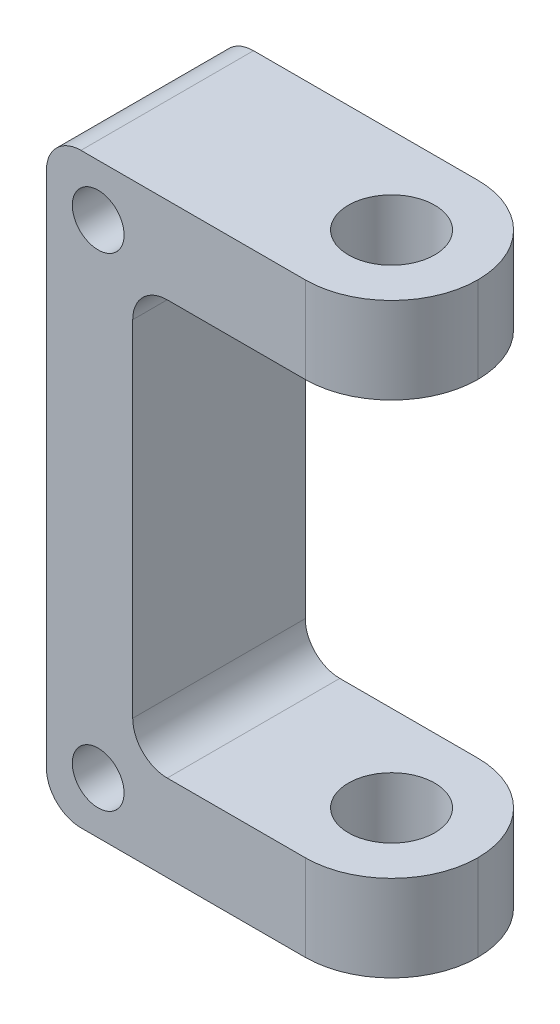
ISO-10303-21;
HEADER;
FILE_DESCRIPTION(('STEP AP214'),'2;1');
FILE_NAME('part.step','',(''),(''),'','','');
FILE_SCHEMA(('AUTOMOTIVE_DESIGN { 1 0 10303 214 1 1 1 1 }'));
ENDSEC;
DATA;
#1=APPLICATION_CONTEXT('core data for automotive mechanical design processes');
#2=APPLICATION_PROTOCOL_DEFINITION('international standard','automotive_design',2000,#1);
#3=PRODUCT_CONTEXT('',#1,'mechanical');
#4=PRODUCT('Part','Part','',(#3));
#5=PRODUCT_RELATED_PRODUCT_CATEGORY('part','',(#4));
#6=PRODUCT_DEFINITION_FORMATION('','',#4);
#7=PRODUCT_DEFINITION_CONTEXT('part definition',#1,'design');
#8=PRODUCT_DEFINITION('design','',#6,#7);
#9=PRODUCT_DEFINITION_SHAPE('','',#8);
#10=(LENGTH_UNIT() NAMED_UNIT(*) SI_UNIT(.MILLI.,.METRE.));
#11=(NAMED_UNIT(*) PLANE_ANGLE_UNIT() SI_UNIT($,.RADIAN.));
#12=(NAMED_UNIT(*) SI_UNIT($,.STERADIAN.) SOLID_ANGLE_UNIT());
#13=UNCERTAINTY_MEASURE_WITH_UNIT(LENGTH_MEASURE(1.E-05),#10,'distance_accuracy_value','');
#14=(GEOMETRIC_REPRESENTATION_CONTEXT(3) GLOBAL_UNCERTAINTY_ASSIGNED_CONTEXT((#13)) GLOBAL_UNIT_ASSIGNED_CONTEXT((#10,
#11,#12)) REPRESENTATION_CONTEXT('',''));
#15=CARTESIAN_POINT('',(0.,0.,0.));
#16=DIRECTION('',(0.,0.,1.));
#17=DIRECTION('',(1.,0.,0.));
#18=AXIS2_PLACEMENT_3D('',#15,#16,#17);
#19=CARTESIAN_POINT('',(-6.35,0.,6.35));
#20=DIRECTION('',(1.,0.,0.));
#21=DIRECTION('',(0.,1.,0.));
#22=AXIS2_PLACEMENT_3D('',#19,#20,#21);
#23=PLANE('',#22);
#24=DIRECTION('',(0.,-1.,0.));
#25=VECTOR('',#24,1.);
#26=CARTESIAN_POINT('',(-6.35,0.,6.35));
#27=LINE('',#26,#25);
#28=CARTESIAN_POINT('',(-6.35,12.7,6.35));
#29=VERTEX_POINT('',#28);
#30=CARTESIAN_POINT('',(-6.35,-12.7,6.35));
#31=VERTEX_POINT('',#30);
#32=EDGE_CURVE('E284',#29,#31,#27,.T.);
#33=ORIENTED_EDGE('',*,*,#32,.T.);
#34=DIRECTION('',(0.,0.,-1.));
#35=VECTOR('',#34,1.);
#36=CARTESIAN_POINT('',(-6.35,-12.7,6.35));
#37=LINE('',#36,#35);
#38=CARTESIAN_POINT('',(-6.35,-12.7,-6.35));
#39=VERTEX_POINT('',#38);
#40=EDGE_CURVE('E221',#31,#39,#37,.T.);
#41=ORIENTED_EDGE('',*,*,#40,.T.);
#42=DIRECTION('',(0.,-1.,0.));
#43=VECTOR('',#42,1.);
#44=CARTESIAN_POINT('',(-6.35,0.,-6.35));
#45=LINE('',#44,#43);
#46=CARTESIAN_POINT('',(-6.35,12.7,-6.35));
#47=VERTEX_POINT('',#46);
#48=EDGE_CURVE('E263',#47,#39,#45,.T.);
#49=ORIENTED_EDGE('',*,*,#48,.F.);
#50=DIRECTION('',(0.,0.,-1.));
#51=VECTOR('',#50,1.);
#52=CARTESIAN_POINT('',(-6.35,12.7,6.35));
#53=LINE('',#52,#51);
#54=EDGE_CURVE('E210',#47,#29,#53,.F.);
#55=ORIENTED_EDGE('',*,*,#54,.T.);
#56=EDGE_LOOP('',(#33,#41,#49,#55));
#57=FACE_BOUND('',#56,.T.);
#58=ADVANCED_FACE('F41',(#57),#23,.T.);
#59=CARTESIAN_POINT('',(0.,15.24,6.35));
#60=DIRECTION('',(0.,-1.,0.));
#61=DIRECTION('',(1.,0.,0.));
#62=AXIS2_PLACEMENT_3D('',#59,#60,#61);
#63=PLANE('',#62);
#64=CARTESIAN_POINT('',(6.34999999999999,15.24,0.));
#65=DIRECTION('',(0.,-1.,0.));
#66=DIRECTION('',(1.,0.,0.));
#67=AXIS2_PLACEMENT_3D('',#64,#65,#66);
#68=CIRCLE('',#67,3.175);
#69=CARTESIAN_POINT('',(9.525,15.24,0.));
#70=VERTEX_POINT('',#69);
#71=EDGE_CURVE('E311',#70,#70,#68,.T.);
#72=ORIENTED_EDGE('',*,*,#71,.F.);
#73=EDGE_LOOP('',(#72));
#74=FACE_BOUND('',#73,.T.);
#75=DIRECTION('',(-1.,0.,0.));
#76=VECTOR('',#75,1.);
#77=CARTESIAN_POINT('',(0.,15.24,6.35));
#78=LINE('',#77,#76);
#79=CARTESIAN_POINT('',(6.35,15.24,6.35));
#80=VERTEX_POINT('',#79);
#81=CARTESIAN_POINT('',(-3.81,15.24,6.35));
#82=VERTEX_POINT('',#81);
#83=EDGE_CURVE('E282',#80,#82,#78,.T.);
#84=ORIENTED_EDGE('',*,*,#83,.T.);
#85=DIRECTION('',(0.,0.,-1.));
#86=VECTOR('',#85,1.);
#87=CARTESIAN_POINT('',(-3.81,15.24,-6.35));
#88=LINE('',#87,#86);
#89=CARTESIAN_POINT('',(-3.81,15.24,-6.35));
#90=VERTEX_POINT('',#89);
#91=EDGE_CURVE('E228',#82,#90,#88,.T.);
#92=ORIENTED_EDGE('',*,*,#91,.T.);
#93=DIRECTION('',(-1.,0.,0.));
#94=VECTOR('',#93,1.);
#95=CARTESIAN_POINT('',(0.,15.24,-6.35));
#96=LINE('',#95,#94);
#97=CARTESIAN_POINT('',(6.35,15.24,-6.35));
#98=VERTEX_POINT('',#97);
#99=EDGE_CURVE('E265',#98,#90,#96,.T.);
#100=ORIENTED_EDGE('',*,*,#99,.F.);
#101=CARTESIAN_POINT('',(6.35,15.24,0.));
#102=DIRECTION('',(0.,-1.,0.));
#103=DIRECTION('',(1.,0.,0.));
#104=AXIS2_PLACEMENT_3D('',#101,#102,#103);
#105=CIRCLE('',#104,6.35);
#106=CARTESIAN_POINT('',(12.7,15.24,0.));
#107=VERTEX_POINT('',#106);
#108=EDGE_CURVE('E200',#98,#107,#105,.T.);
#109=ORIENTED_EDGE('',*,*,#108,.T.);
#110=CARTESIAN_POINT('',(6.35,15.24,0.));
#111=DIRECTION('',(0.,-1.,0.));
#112=DIRECTION('',(1.,0.,0.));
#113=AXIS2_PLACEMENT_3D('',#110,#111,#112);
#114=CIRCLE('',#113,6.35);
#115=EDGE_CURVE('E197',#107,#80,#114,.T.);
#116=ORIENTED_EDGE('',*,*,#115,.T.);
#117=EDGE_LOOP('',(#84,#92,#100,#109,#116));
#118=FACE_BOUND('',#117,.T.);
#119=ADVANCED_FACE('F286',(#74,#118),#63,.T.);
#120=CARTESIAN_POINT('',(0.,21.59,6.35));
#121=DIRECTION('',(0.,1.,0.));
#122=DIRECTION('',(-1.,0.,0.));
#123=AXIS2_PLACEMENT_3D('',#120,#121,#122);
#124=PLANE('',#123);
#125=CARTESIAN_POINT('',(6.34999999999999,21.59,0.));
#126=DIRECTION('',(0.,1.,0.));
#127=DIRECTION('',(0.,0.,1.));
#128=AXIS2_PLACEMENT_3D('',#125,#126,#127);
#129=CIRCLE('',#128,3.175);
#130=CARTESIAN_POINT('',(6.34999999999999,21.59,3.175));
#131=VERTEX_POINT('',#130);
#132=EDGE_CURVE('E214',#131,#131,#129,.T.);
#133=ORIENTED_EDGE('',*,*,#132,.F.);
#134=EDGE_LOOP('',(#133));
#135=FACE_BOUND('',#134,.T.);
#136=DIRECTION('',(1.,0.,0.));
#137=VECTOR('',#136,1.);
#138=CARTESIAN_POINT('',(0.,21.59,-6.35));
#139=LINE('',#138,#137);
#140=CARTESIAN_POINT('',(-10.16,21.59,-6.35));
#141=VERTEX_POINT('',#140);
#142=CARTESIAN_POINT('',(6.35,21.59,-6.35));
#143=VERTEX_POINT('',#142);
#144=EDGE_CURVE('E317',#141,#143,#139,.T.);
#145=ORIENTED_EDGE('',*,*,#144,.F.);
#146=DIRECTION('',(0.,0.,-1.));
#147=VECTOR('',#146,1.);
#148=CARTESIAN_POINT('',(-10.16,21.59,6.35));
#149=LINE('',#148,#147);
#150=CARTESIAN_POINT('',(-10.16,21.59,6.35));
#151=VERTEX_POINT('',#150);
#152=EDGE_CURVE('E57',#141,#151,#149,.F.);
#153=ORIENTED_EDGE('',*,*,#152,.T.);
#154=DIRECTION('',(1.,0.,0.));
#155=VECTOR('',#154,1.);
#156=CARTESIAN_POINT('',(0.,21.59,6.35));
#157=LINE('',#156,#155);
#158=CARTESIAN_POINT('',(6.35,21.59,6.35));
#159=VERTEX_POINT('',#158);
#160=EDGE_CURVE('E289',#151,#159,#157,.T.);
#161=ORIENTED_EDGE('',*,*,#160,.T.);
#162=CARTESIAN_POINT('',(6.35,21.59,0.));
#163=DIRECTION('',(0.,1.,0.));
#164=DIRECTION('',(-1.,0.,0.));
#165=AXIS2_PLACEMENT_3D('',#162,#163,#164);
#166=CIRCLE('',#165,6.35);
#167=CARTESIAN_POINT('',(12.7,21.59,0.));
#168=VERTEX_POINT('',#167);
#169=EDGE_CURVE('E203',#159,#168,#166,.T.);
#170=ORIENTED_EDGE('',*,*,#169,.T.);
#171=CARTESIAN_POINT('',(6.35,21.59,0.));
#172=DIRECTION('',(0.,1.,0.));
#173=DIRECTION('',(-1.,0.,0.));
#174=AXIS2_PLACEMENT_3D('',#171,#172,#173);
#175=CIRCLE('',#174,6.35);
#176=EDGE_CURVE('E206',#168,#143,#175,.T.);
#177=ORIENTED_EDGE('',*,*,#176,.T.);
#178=EDGE_LOOP('',(#145,#153,#161,#170,#177));
#179=FACE_BOUND('',#178,.T.);
#180=ADVANCED_FACE('F370',(#135,#179),#124,.T.);
#181=CARTESIAN_POINT('',(-12.7,0.,6.35));
#182=DIRECTION('',(1.,0.,0.));
#183=DIRECTION('',(0.,1.,0.));
#184=AXIS2_PLACEMENT_3D('',#181,#182,#183);
#185=PLANE('',#184);
#186=DIRECTION('',(0.,-1.,0.));
#187=VECTOR('',#186,1.);
#188=CARTESIAN_POINT('',(-12.7,0.,-6.35));
#189=LINE('',#188,#187);
#190=CARTESIAN_POINT('',(-12.7,19.05,-6.35));
#191=VERTEX_POINT('',#190);
#192=CARTESIAN_POINT('',(-12.7,-19.05,-6.35));
#193=VERTEX_POINT('',#192);
#194=EDGE_CURVE('E320',#191,#193,#189,.T.);
#195=ORIENTED_EDGE('',*,*,#194,.T.);
#196=DIRECTION('',(0.,0.,-1.));
#197=VECTOR('',#196,1.);
#198=CARTESIAN_POINT('',(-12.7,-19.05,6.35));
#199=LINE('',#198,#197);
#200=CARTESIAN_POINT('',(-12.7,-19.05,6.35));
#201=VERTEX_POINT('',#200);
#202=EDGE_CURVE('E65',#193,#201,#199,.F.);
#203=ORIENTED_EDGE('',*,*,#202,.T.);
#204=DIRECTION('',(0.,-1.,0.));
#205=VECTOR('',#204,1.);
#206=CARTESIAN_POINT('',(-12.7,0.,6.35));
#207=LINE('',#206,#205);
#208=CARTESIAN_POINT('',(-12.7,19.05,6.35));
#209=VERTEX_POINT('',#208);
#210=EDGE_CURVE('E293',#209,#201,#207,.T.);
#211=ORIENTED_EDGE('',*,*,#210,.F.);
#212=DIRECTION('',(0.,0.,-1.));
#213=VECTOR('',#212,1.);
#214=CARTESIAN_POINT('',(-12.7,19.05,-6.35));
#215=LINE('',#214,#213);
#216=EDGE_CURVE('E242',#209,#191,#215,.T.);
#217=ORIENTED_EDGE('',*,*,#216,.T.);
#218=EDGE_LOOP('',(#195,#203,#211,#217));
#219=FACE_BOUND('',#218,.T.);
#220=ADVANCED_FACE('F416',(#219),#185,.F.);
#221=CARTESIAN_POINT('',(0.,-21.59,6.35));
#222=DIRECTION('',(0.,1.,0.));
#223=DIRECTION('',(0.,0.,1.));
#224=AXIS2_PLACEMENT_3D('',#221,#222,#223);
#225=PLANE('',#224);
#226=CARTESIAN_POINT('',(6.34999999999999,-21.59,0.));
#227=DIRECTION('',(0.,1.,0.));
#228=DIRECTION('',(0.,0.,1.));
#229=AXIS2_PLACEMENT_3D('',#226,#227,#228);
#230=CIRCLE('',#229,3.175);
#231=CARTESIAN_POINT('',(6.34999999999999,-21.59,3.175));
#232=VERTEX_POINT('',#231);
#233=EDGE_CURVE('E327',#232,#232,#230,.T.);
#234=ORIENTED_EDGE('',*,*,#233,.T.);
#235=EDGE_LOOP('',(#234));
#236=FACE_BOUND('',#235,.T.);
#237=DIRECTION('',(1.,0.,0.));
#238=VECTOR('',#237,1.);
#239=CARTESIAN_POINT('',(0.,-21.59,6.35));
#240=LINE('',#239,#238);
#241=CARTESIAN_POINT('',(-10.16,-21.59,6.35));
#242=VERTEX_POINT('',#241);
#243=CARTESIAN_POINT('',(6.35,-21.59,6.35));
#244=VERTEX_POINT('',#243);
#245=EDGE_CURVE('E301',#242,#244,#240,.T.);
#246=ORIENTED_EDGE('',*,*,#245,.F.);
#247=DIRECTION('',(0.,0.,-1.));
#248=VECTOR('',#247,1.);
#249=CARTESIAN_POINT('',(-10.16,-21.59,6.35));
#250=LINE('',#249,#248);
#251=CARTESIAN_POINT('',(-10.16,-21.59,-6.35));
#252=VERTEX_POINT('',#251);
#253=EDGE_CURVE('E232',#242,#252,#250,.T.);
#254=ORIENTED_EDGE('',*,*,#253,.T.);
#255=DIRECTION('',(1.,0.,0.));
#256=VECTOR('',#255,1.);
#257=CARTESIAN_POINT('',(0.,-21.59,-6.35));
#258=LINE('',#257,#256);
#259=CARTESIAN_POINT('',(6.35,-21.59,-6.35));
#260=VERTEX_POINT('',#259);
#261=EDGE_CURVE('E169',#252,#260,#258,.T.);
#262=ORIENTED_EDGE('',*,*,#261,.T.);
#263=CARTESIAN_POINT('',(6.35,-21.59,0.));
#264=DIRECTION('',(0.,1.,0.));
#265=DIRECTION('',(0.,0.,1.));
#266=AXIS2_PLACEMENT_3D('',#263,#264,#265);
#267=CIRCLE('',#266,6.35);
#268=CARTESIAN_POINT('',(12.7,-21.59,0.));
#269=VERTEX_POINT('',#268);
#270=EDGE_CURVE('E173',#260,#269,#267,.F.);
#271=ORIENTED_EDGE('',*,*,#270,.T.);
#272=CARTESIAN_POINT('',(6.35,-21.59,0.));
#273=DIRECTION('',(0.,1.,0.));
#274=DIRECTION('',(0.,0.,1.));
#275=AXIS2_PLACEMENT_3D('',#272,#273,#274);
#276=CIRCLE('',#275,6.35);
#277=EDGE_CURVE('E175',#269,#244,#276,.F.);
#278=ORIENTED_EDGE('',*,*,#277,.T.);
#279=EDGE_LOOP('',(#246,#254,#262,#271,#278));
#280=FACE_BOUND('',#279,.T.);
#281=ADVANCED_FACE('F377',(#236,#280),#225,.F.);
#282=CARTESIAN_POINT('',(-8.89,17.78,6.35));
#283=DIRECTION('',(0.,0.,-1.));
#284=DIRECTION('',(-1.,0.,0.));
#285=AXIS2_PLACEMENT_3D('',#282,#283,#284);
#286=CYLINDRICAL_SURFACE('',#285,1.905);
#287=CARTESIAN_POINT('',(-8.89,17.78,6.35));
#288=DIRECTION('',(0.,0.,1.));
#289=DIRECTION('',(1.,0.,0.));
#290=AXIS2_PLACEMENT_3D('',#287,#288,#289);
#291=CIRCLE('',#290,1.905);
#292=CARTESIAN_POINT('',(-6.985,17.78,6.35));
#293=VERTEX_POINT('',#292);
#294=EDGE_CURVE('E295',#293,#293,#291,.T.);
#295=ORIENTED_EDGE('',*,*,#294,.T.);
#296=EDGE_LOOP('',(#295));
#297=FACE_BOUND('',#296,.T.);
#298=CARTESIAN_POINT('',(-8.89,17.78,-6.35));
#299=DIRECTION('',(0.,0.,1.));
#300=DIRECTION('',(1.,0.,0.));
#301=AXIS2_PLACEMENT_3D('',#298,#299,#300);
#302=CIRCLE('',#301,1.905);
#303=CARTESIAN_POINT('',(-6.985,17.78,-6.35));
#304=VERTEX_POINT('',#303);
#305=EDGE_CURVE('E274',#304,#304,#302,.T.);
#306=ORIENTED_EDGE('',*,*,#305,.F.);
#307=EDGE_LOOP('',(#306));
#308=FACE_BOUND('',#307,.T.);
#309=ADVANCED_FACE('F348',(#297,#308),#286,.F.);
#310=CARTESIAN_POINT('',(-8.89,-17.78,6.35));
#311=DIRECTION('',(0.,0.,-1.));
#312=DIRECTION('',(-1.,0.,0.));
#313=AXIS2_PLACEMENT_3D('',#310,#311,#312);
#314=CYLINDRICAL_SURFACE('',#313,1.905);
#315=CARTESIAN_POINT('',(-8.89,-17.78,6.35));
#316=DIRECTION('',(0.,0.,1.));
#317=DIRECTION('',(1.,0.,0.));
#318=AXIS2_PLACEMENT_3D('',#315,#316,#317);
#319=CIRCLE('',#318,1.905);
#320=CARTESIAN_POINT('',(-6.985,-17.78,6.35));
#321=VERTEX_POINT('',#320);
#322=EDGE_CURVE('E168',#321,#321,#319,.T.);
#323=ORIENTED_EDGE('',*,*,#322,.T.);
#324=EDGE_LOOP('',(#323));
#325=FACE_BOUND('',#324,.T.);
#326=CARTESIAN_POINT('',(-8.89,-17.78,-6.35));
#327=DIRECTION('',(0.,0.,1.));
#328=DIRECTION('',(1.,0.,0.));
#329=AXIS2_PLACEMENT_3D('',#326,#327,#328);
#330=CIRCLE('',#329,1.905);
#331=CARTESIAN_POINT('',(-6.985,-17.78,-6.35));
#332=VERTEX_POINT('',#331);
#333=EDGE_CURVE('E307',#332,#332,#330,.T.);
#334=ORIENTED_EDGE('',*,*,#333,.F.);
#335=EDGE_LOOP('',(#334));
#336=FACE_BOUND('',#335,.T.);
#337=ADVANCED_FACE('F361',(#325,#336),#314,.F.);
#338=CARTESIAN_POINT('',(0.,-15.24,6.35));
#339=DIRECTION('',(0.,-1.,0.));
#340=DIRECTION('',(1.,0.,0.));
#341=AXIS2_PLACEMENT_3D('',#338,#339,#340);
#342=PLANE('',#341);
#343=CARTESIAN_POINT('',(6.34999999999999,-15.24,0.));
#344=DIRECTION('',(0.,-1.,0.));
#345=DIRECTION('',(1.,0.,0.));
#346=AXIS2_PLACEMENT_3D('',#343,#344,#345);
#347=CIRCLE('',#346,3.175);
#348=CARTESIAN_POINT('',(9.525,-15.24,0.));
#349=VERTEX_POINT('',#348);
#350=EDGE_CURVE('E324',#349,#349,#347,.T.);
#351=ORIENTED_EDGE('',*,*,#350,.T.);
#352=EDGE_LOOP('',(#351));
#353=FACE_BOUND('',#352,.T.);
#354=DIRECTION('',(-1.,0.,0.));
#355=VECTOR('',#354,1.);
#356=CARTESIAN_POINT('',(0.,-15.24,-6.35));
#357=LINE('',#356,#355);
#358=CARTESIAN_POINT('',(6.35,-15.24,-6.35));
#359=VERTEX_POINT('',#358);
#360=CARTESIAN_POINT('',(-3.81,-15.24,-6.35));
#361=VERTEX_POINT('',#360);
#362=EDGE_CURVE('E148',#359,#361,#357,.T.);
#363=ORIENTED_EDGE('',*,*,#362,.T.);
#364=DIRECTION('',(0.,0.,-1.));
#365=VECTOR('',#364,1.);
#366=CARTESIAN_POINT('',(-3.81,-15.24,6.35));
#367=LINE('',#366,#365);
#368=CARTESIAN_POINT('',(-3.81,-15.24,6.35));
#369=VERTEX_POINT('',#368);
#370=EDGE_CURVE('E225',#361,#369,#367,.F.);
#371=ORIENTED_EDGE('',*,*,#370,.T.);
#372=DIRECTION('',(-1.,0.,0.));
#373=VECTOR('',#372,1.);
#374=CARTESIAN_POINT('',(0.,-15.24,6.35));
#375=LINE('',#374,#373);
#376=CARTESIAN_POINT('',(6.35,-15.24,6.35));
#377=VERTEX_POINT('',#376);
#378=EDGE_CURVE('E183',#377,#369,#375,.T.);
#379=ORIENTED_EDGE('',*,*,#378,.F.);
#380=CARTESIAN_POINT('',(6.35,-15.24,0.));
#381=DIRECTION('',(0.,-1.,0.));
#382=DIRECTION('',(1.,0.,0.));
#383=AXIS2_PLACEMENT_3D('',#380,#381,#382);
#384=CIRCLE('',#383,6.35);
#385=CARTESIAN_POINT('',(12.7,-15.24,0.));
#386=VERTEX_POINT('',#385);
#387=EDGE_CURVE('E152',#377,#386,#384,.F.);
#388=ORIENTED_EDGE('',*,*,#387,.T.);
#389=CARTESIAN_POINT('',(6.35,-15.24,0.));
#390=DIRECTION('',(0.,-1.,0.));
#391=DIRECTION('',(1.,0.,0.));
#392=AXIS2_PLACEMENT_3D('',#389,#390,#391);
#393=CIRCLE('',#392,6.35);
#394=EDGE_CURVE('E145',#386,#359,#393,.F.);
#395=ORIENTED_EDGE('',*,*,#394,.T.);
#396=EDGE_LOOP('',(#363,#371,#379,#388,#395));
#397=FACE_BOUND('',#396,.T.);
#398=ADVANCED_FACE('F147',(#353,#397),#342,.F.);
#399=CARTESIAN_POINT('',(0.,0.,6.35));
#400=DIRECTION('',(0.,0.,1.));
#401=DIRECTION('',(1.,0.,0.));
#402=AXIS2_PLACEMENT_3D('',#399,#400,#401);
#403=PLANE('',#402);
#404=ORIENTED_EDGE('',*,*,#322,.F.);
#405=EDGE_LOOP('',(#404));
#406=FACE_BOUND('',#405,.T.);
#407=ORIENTED_EDGE('',*,*,#294,.F.);
#408=EDGE_LOOP('',(#407));
#409=FACE_BOUND('',#408,.T.);
#410=ORIENTED_EDGE('',*,*,#210,.T.);
#411=CARTESIAN_POINT('',(-10.16,-19.05,6.35));
#412=DIRECTION('',(0.,0.,1.));
#413=DIRECTION('',(1.,0.,0.));
#414=AXIS2_PLACEMENT_3D('',#411,#412,#413);
#415=CIRCLE('',#414,2.54);
#416=EDGE_CURVE('E251',#201,#242,#415,.T.);
#417=ORIENTED_EDGE('',*,*,#416,.T.);
#418=ORIENTED_EDGE('',*,*,#245,.T.);
#419=DIRECTION('',(0.,-1.,0.));
#420=VECTOR('',#419,1.);
#421=CARTESIAN_POINT('',(6.35,0.,6.35));
#422=LINE('',#421,#420);
#423=EDGE_CURVE('E194',#244,#377,#422,.F.);
#424=ORIENTED_EDGE('',*,*,#423,.T.);
#425=ORIENTED_EDGE('',*,*,#378,.T.);
#426=CARTESIAN_POINT('',(-3.81,-12.7,6.35));
#427=DIRECTION('',(0.,0.,1.));
#428=DIRECTION('',(1.,0.,0.));
#429=AXIS2_PLACEMENT_3D('',#426,#427,#428);
#430=CIRCLE('',#429,2.54);
#431=EDGE_CURVE('E258',#369,#31,#430,.F.);
#432=ORIENTED_EDGE('',*,*,#431,.T.);
#433=ORIENTED_EDGE('',*,*,#32,.F.);
#434=CARTESIAN_POINT('',(-3.81,12.7,6.35));
#435=DIRECTION('',(0.,0.,1.));
#436=DIRECTION('',(1.,0.,0.));
#437=AXIS2_PLACEMENT_3D('',#434,#435,#436);
#438=CIRCLE('',#437,2.54);
#439=EDGE_CURVE('E11',#29,#82,#438,.F.);
#440=ORIENTED_EDGE('',*,*,#439,.T.);
#441=ORIENTED_EDGE('',*,*,#83,.F.);
#442=DIRECTION('',(0.,-1.,0.));
#443=VECTOR('',#442,1.);
#444=CARTESIAN_POINT('',(6.35,0.,6.35));
#445=LINE('',#444,#443);
#446=EDGE_CURVE('E158',#80,#159,#445,.F.);
#447=ORIENTED_EDGE('',*,*,#446,.T.);
#448=ORIENTED_EDGE('',*,*,#160,.F.);
#449=CARTESIAN_POINT('',(-10.16,19.05,6.35));
#450=DIRECTION('',(0.,0.,1.));
#451=DIRECTION('',(1.,0.,0.));
#452=AXIS2_PLACEMENT_3D('',#449,#450,#451);
#453=CIRCLE('',#452,2.54);
#454=EDGE_CURVE('E248',#151,#209,#453,.T.);
#455=ORIENTED_EDGE('',*,*,#454,.T.);
#456=EDGE_LOOP('',(#410,#417,#418,#424,#425,#432,#433,#440,#441,#447,#448,#455));
#457=FACE_BOUND('',#456,.T.);
#458=ADVANCED_FACE('F281',(#406,#409,#457),#403,.T.);
#459=CARTESIAN_POINT('',(0.,0.,-6.35));
#460=DIRECTION('',(0.,0.,1.));
#461=DIRECTION('',(1.,0.,0.));
#462=AXIS2_PLACEMENT_3D('',#459,#460,#461);
#463=PLANE('',#462);
#464=ORIENTED_EDGE('',*,*,#333,.T.);
#465=EDGE_LOOP('',(#464));
#466=FACE_BOUND('',#465,.T.);
#467=ORIENTED_EDGE('',*,*,#305,.T.);
#468=EDGE_LOOP('',(#467));
#469=FACE_BOUND('',#468,.T.);
#470=ORIENTED_EDGE('',*,*,#261,.F.);
#471=CARTESIAN_POINT('',(-10.16,-19.05,-6.35));
#472=DIRECTION('',(0.,0.,1.));
#473=DIRECTION('',(1.,0.,0.));
#474=AXIS2_PLACEMENT_3D('',#471,#472,#473);
#475=CIRCLE('',#474,2.54);
#476=EDGE_CURVE('E239',#252,#193,#475,.F.);
#477=ORIENTED_EDGE('',*,*,#476,.T.);
#478=ORIENTED_EDGE('',*,*,#194,.F.);
#479=CARTESIAN_POINT('',(-10.16,19.05,-6.35));
#480=DIRECTION('',(0.,0.,1.));
#481=DIRECTION('',(1.,0.,0.));
#482=AXIS2_PLACEMENT_3D('',#479,#480,#481);
#483=CIRCLE('',#482,2.54);
#484=EDGE_CURVE('E236',#191,#141,#483,.F.);
#485=ORIENTED_EDGE('',*,*,#484,.T.);
#486=ORIENTED_EDGE('',*,*,#144,.T.);
#487=DIRECTION('',(0.,-1.,0.));
#488=VECTOR('',#487,1.);
#489=CARTESIAN_POINT('',(6.35,15.24,-6.35));
#490=LINE('',#489,#488);
#491=EDGE_CURVE('E176',#143,#98,#490,.T.);
#492=ORIENTED_EDGE('',*,*,#491,.T.);
#493=ORIENTED_EDGE('',*,*,#99,.T.);
#494=CARTESIAN_POINT('',(-3.81,12.7,-6.35));
#495=DIRECTION('',(0.,0.,1.));
#496=DIRECTION('',(1.,0.,0.));
#497=AXIS2_PLACEMENT_3D('',#494,#495,#496);
#498=CIRCLE('',#497,2.54);
#499=EDGE_CURVE('E50',#90,#47,#498,.T.);
#500=ORIENTED_EDGE('',*,*,#499,.T.);
#501=ORIENTED_EDGE('',*,*,#48,.T.);
#502=CARTESIAN_POINT('',(-3.81,-12.7,-6.35));
#503=DIRECTION('',(0.,0.,1.));
#504=DIRECTION('',(1.,0.,0.));
#505=AXIS2_PLACEMENT_3D('',#502,#503,#504);
#506=CIRCLE('',#505,2.54);
#507=EDGE_CURVE('E166',#39,#361,#506,.T.);
#508=ORIENTED_EDGE('',*,*,#507,.T.);
#509=ORIENTED_EDGE('',*,*,#362,.F.);
#510=DIRECTION('',(0.,-1.,0.));
#511=VECTOR('',#510,1.);
#512=CARTESIAN_POINT('',(6.35,-21.59,-6.35));
#513=LINE('',#512,#511);
#514=EDGE_CURVE('E164',#359,#260,#513,.T.);
#515=ORIENTED_EDGE('',*,*,#514,.T.);
#516=EDGE_LOOP('',(#470,#477,#478,#485,#486,#492,#493,#500,#501,#508,#509,#515));
#517=FACE_BOUND('',#516,.T.);
#518=ADVANCED_FACE('F163',(#466,#469,#517),#463,.F.);
#519=CARTESIAN_POINT('',(6.34999999999999,-21.59,0.));
#520=DIRECTION('',(0.,1.,0.));
#521=DIRECTION('',(0.,0.,1.));
#522=AXIS2_PLACEMENT_3D('',#519,#520,#521);
#523=CYLINDRICAL_SURFACE('',#522,3.175);
#524=ORIENTED_EDGE('',*,*,#233,.F.);
#525=EDGE_LOOP('',(#524));
#526=FACE_BOUND('',#525,.T.);
#527=ORIENTED_EDGE('',*,*,#350,.F.);
#528=EDGE_LOOP('',(#527));
#529=FACE_BOUND('',#528,.T.);
#530=ADVANCED_FACE('F358',(#526,#529),#523,.F.);
#531=ORIENTED_EDGE('',*,*,#71,.T.);
#532=EDGE_LOOP('',(#531));
#533=FACE_BOUND('',#532,.T.);
#534=ORIENTED_EDGE('',*,*,#132,.T.);
#535=EDGE_LOOP('',(#534));
#536=FACE_BOUND('',#535,.T.);
#537=ADVANCED_FACE('F387',(#533,#536),#523,.F.);
#538=CARTESIAN_POINT('',(6.35,0.,0.));
#539=DIRECTION('',(0.,-1.,0.));
#540=DIRECTION('',(1.,0.,0.));
#541=AXIS2_PLACEMENT_3D('',#538,#539,#540);
#542=CYLINDRICAL_SURFACE('',#541,6.35);
#543=DIRECTION('',(0.,-1.,0.));
#544=VECTOR('',#543,1.);
#545=CARTESIAN_POINT('',(12.7,0.,0.));
#546=LINE('',#545,#544);
#547=EDGE_CURVE('E211',#386,#269,#546,.T.);
#548=ORIENTED_EDGE('',*,*,#547,.F.);
#549=ORIENTED_EDGE('',*,*,#387,.F.);
#550=ORIENTED_EDGE('',*,*,#423,.F.);
#551=ORIENTED_EDGE('',*,*,#277,.F.);
#552=EDGE_LOOP('',(#548,#549,#550,#551));
#553=FACE_BOUND('',#552,.T.);
#554=ADVANCED_FACE('F384',(#553),#542,.T.);
#555=CARTESIAN_POINT('',(6.35,0.,0.));
#556=DIRECTION('',(0.,1.,0.));
#557=DIRECTION('',(-1.,0.,0.));
#558=AXIS2_PLACEMENT_3D('',#555,#556,#557);
#559=CYLINDRICAL_SURFACE('',#558,6.35);
#560=ORIENTED_EDGE('',*,*,#394,.F.);
#561=ORIENTED_EDGE('',*,*,#547,.T.);
#562=ORIENTED_EDGE('',*,*,#270,.F.);
#563=ORIENTED_EDGE('',*,*,#514,.F.);
#564=EDGE_LOOP('',(#560,#561,#562,#563));
#565=FACE_BOUND('',#564,.T.);
#566=ADVANCED_FACE('F172',(#565),#559,.T.);
#567=CARTESIAN_POINT('',(6.35,0.,0.));
#568=DIRECTION('',(0.,-1.,0.));
#569=DIRECTION('',(1.,0.,0.));
#570=AXIS2_PLACEMENT_3D('',#567,#568,#569);
#571=CYLINDRICAL_SURFACE('',#570,6.35);
#572=DIRECTION('',(0.,-1.,0.));
#573=VECTOR('',#572,1.);
#574=CARTESIAN_POINT('',(12.7,0.,0.));
#575=LINE('',#574,#573);
#576=EDGE_CURVE('E215',#168,#107,#575,.T.);
#577=ORIENTED_EDGE('',*,*,#576,.F.);
#578=ORIENTED_EDGE('',*,*,#169,.F.);
#579=ORIENTED_EDGE('',*,*,#446,.F.);
#580=ORIENTED_EDGE('',*,*,#115,.F.);
#581=EDGE_LOOP('',(#577,#578,#579,#580));
#582=FACE_BOUND('',#581,.T.);
#583=ADVANCED_FACE('F383',(#582),#571,.T.);
#584=CARTESIAN_POINT('',(6.35,0.,0.));
#585=DIRECTION('',(0.,1.,0.));
#586=DIRECTION('',(-1.,0.,0.));
#587=AXIS2_PLACEMENT_3D('',#584,#585,#586);
#588=CYLINDRICAL_SURFACE('',#587,6.35);
#589=ORIENTED_EDGE('',*,*,#176,.F.);
#590=ORIENTED_EDGE('',*,*,#576,.T.);
#591=ORIENTED_EDGE('',*,*,#108,.F.);
#592=ORIENTED_EDGE('',*,*,#491,.F.);
#593=EDGE_LOOP('',(#589,#590,#591,#592));
#594=FACE_BOUND('',#593,.T.);
#595=ADVANCED_FACE('F389',(#594),#588,.T.);
#596=CARTESIAN_POINT('',(-3.81,-12.7,6.35));
#597=DIRECTION('',(0.,0.,-1.));
#598=DIRECTION('',(-1.,0.,0.));
#599=AXIS2_PLACEMENT_3D('',#596,#597,#598);
#600=CYLINDRICAL_SURFACE('',#599,2.54);
#601=ORIENTED_EDGE('',*,*,#431,.F.);
#602=ORIENTED_EDGE('',*,*,#370,.F.);
#603=ORIENTED_EDGE('',*,*,#507,.F.);
#604=ORIENTED_EDGE('',*,*,#40,.F.);
#605=EDGE_LOOP('',(#601,#602,#603,#604));
#606=FACE_BOUND('',#605,.T.);
#607=ADVANCED_FACE('F392',(#606),#600,.F.);
#608=CARTESIAN_POINT('',(-3.81,12.7,6.35));
#609=DIRECTION('',(0.,0.,1.));
#610=DIRECTION('',(1.,0.,0.));
#611=AXIS2_PLACEMENT_3D('',#608,#609,#610);
#612=CYLINDRICAL_SURFACE('',#611,2.54);
#613=ORIENTED_EDGE('',*,*,#439,.F.);
#614=ORIENTED_EDGE('',*,*,#54,.F.);
#615=ORIENTED_EDGE('',*,*,#499,.F.);
#616=ORIENTED_EDGE('',*,*,#91,.F.);
#617=EDGE_LOOP('',(#613,#614,#615,#616));
#618=FACE_BOUND('',#617,.T.);
#619=ADVANCED_FACE('F277',(#618),#612,.F.);
#620=CARTESIAN_POINT('',(-10.16,-19.05,6.35));
#621=DIRECTION('',(0.,0.,-1.));
#622=DIRECTION('',(-1.,0.,0.));
#623=AXIS2_PLACEMENT_3D('',#620,#621,#622);
#624=CYLINDRICAL_SURFACE('',#623,2.54);
#625=ORIENTED_EDGE('',*,*,#416,.F.);
#626=ORIENTED_EDGE('',*,*,#202,.F.);
#627=ORIENTED_EDGE('',*,*,#476,.F.);
#628=ORIENTED_EDGE('',*,*,#253,.F.);
#629=EDGE_LOOP('',(#625,#626,#627,#628));
#630=FACE_BOUND('',#629,.T.);
#631=ADVANCED_FACE('F401',(#630),#624,.T.);
#632=CARTESIAN_POINT('',(-10.16,19.05,6.35));
#633=DIRECTION('',(0.,0.,1.));
#634=DIRECTION('',(1.,0.,0.));
#635=AXIS2_PLACEMENT_3D('',#632,#633,#634);
#636=CYLINDRICAL_SURFACE('',#635,2.54);
#637=ORIENTED_EDGE('',*,*,#454,.F.);
#638=ORIENTED_EDGE('',*,*,#152,.F.);
#639=ORIENTED_EDGE('',*,*,#484,.F.);
#640=ORIENTED_EDGE('',*,*,#216,.F.);
#641=EDGE_LOOP('',(#637,#638,#639,#640));
#642=FACE_BOUND('',#641,.T.);
#643=ADVANCED_FACE('F43',(#642),#636,.T.);
#644=CLOSED_SHELL('',(#58,#119,#180,#220,#281,#309,#337,#398,#458,#518,#530,#537,#554,#566,#583,
#595,#607,#619,#631,#643));
#645=MANIFOLD_SOLID_BREP('B2',#644);
#646=ADVANCED_BREP_SHAPE_REPRESENTATION('',(#18,#645),#14);
#647=SHAPE_DEFINITION_REPRESENTATION(#9,#646);
ENDSEC;
END-ISO-10303-21;
